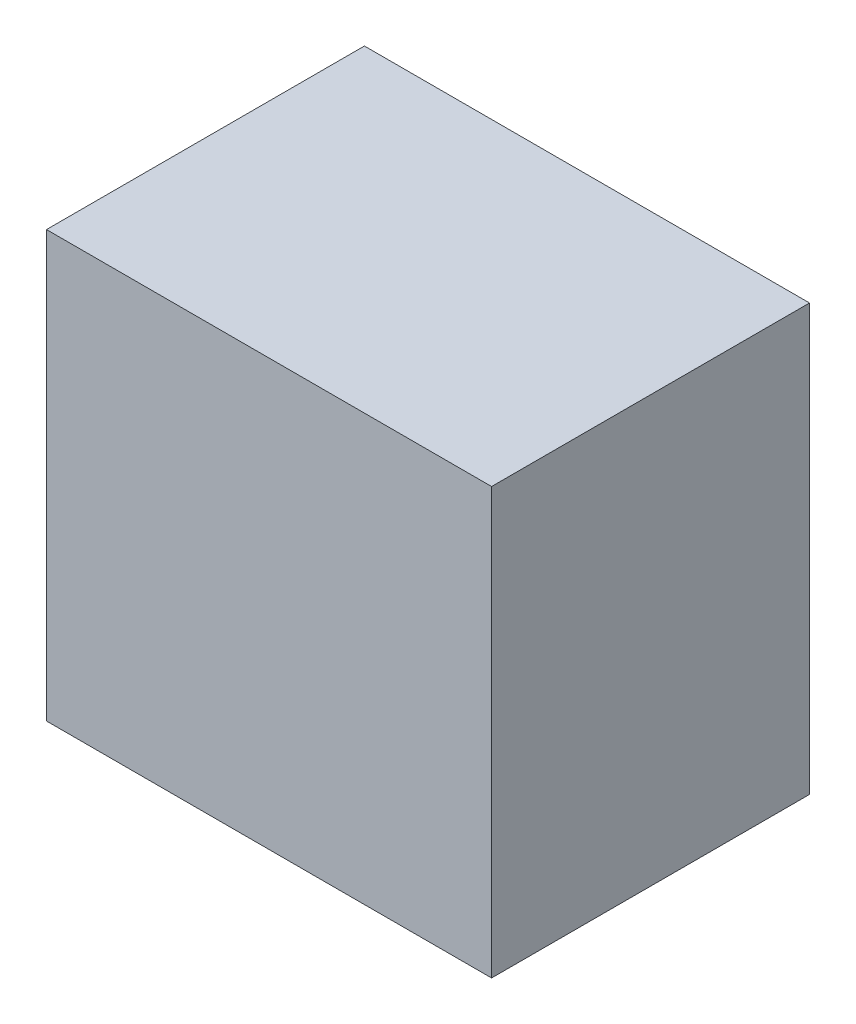
ISO-10303-21;
HEADER;
FILE_DESCRIPTION(('STEP AP214'),'2;1');
FILE_NAME('part.step','',(''),(''),'','','');
FILE_SCHEMA(('AUTOMOTIVE_DESIGN { 1 0 10303 214 1 1 1 1 }'));
ENDSEC;
DATA;
#1=APPLICATION_CONTEXT('core data for automotive mechanical design processes');
#2=APPLICATION_PROTOCOL_DEFINITION('international standard','automotive_design',2000,#1);
#3=PRODUCT_CONTEXT('',#1,'mechanical');
#4=PRODUCT('Part','Part','',(#3));
#5=PRODUCT_RELATED_PRODUCT_CATEGORY('part','',(#4));
#6=PRODUCT_DEFINITION_FORMATION('','',#4);
#7=PRODUCT_DEFINITION_CONTEXT('part definition',#1,'design');
#8=PRODUCT_DEFINITION('design','',#6,#7);
#9=PRODUCT_DEFINITION_SHAPE('','',#8);
#10=(LENGTH_UNIT() NAMED_UNIT(*) SI_UNIT(.MILLI.,.METRE.));
#11=(NAMED_UNIT(*) PLANE_ANGLE_UNIT() SI_UNIT($,.RADIAN.));
#12=(NAMED_UNIT(*) SI_UNIT($,.STERADIAN.) SOLID_ANGLE_UNIT());
#13=UNCERTAINTY_MEASURE_WITH_UNIT(LENGTH_MEASURE(1.E-05),#10,'distance_accuracy_value','');
#14=(GEOMETRIC_REPRESENTATION_CONTEXT(3) GLOBAL_UNCERTAINTY_ASSIGNED_CONTEXT((#13)) GLOBAL_UNIT_ASSIGNED_CONTEXT((#10,
#11,#12)) REPRESENTATION_CONTEXT('',''));
#15=CARTESIAN_POINT('',(0.,0.,0.));
#16=DIRECTION('',(0.,0.,1.));
#17=DIRECTION('',(1.,0.,0.));
#18=AXIS2_PLACEMENT_3D('',#15,#16,#17);
#19=CARTESIAN_POINT('',(-68.7479338842975,74.7830578512396,127.));
#20=DIRECTION('',(1.,0.,0.));
#21=DIRECTION('',(0.,0.,-1.));
#22=AXIS2_PLACEMENT_3D('',#19,#20,#21);
#23=PLANE('',#22);
#24=DIRECTION('',(0.,-1.,0.));
#25=VECTOR('',#24,1.);
#26=CARTESIAN_POINT('',(-68.7479338842975,74.7830578512396,0.));
#27=LINE('',#26,#25);
#28=CARTESIAN_POINT('',(-68.7479338842975,74.7830578512396,0.));
#29=VERTEX_POINT('',#28);
#30=CARTESIAN_POINT('',(-68.7479338842975,-95.25,0.));
#31=VERTEX_POINT('',#30);
#32=EDGE_CURVE('E96',#29,#31,#27,.T.);
#33=ORIENTED_EDGE('',*,*,#32,.T.);
#34=DIRECTION('',(0.,0.,-1.));
#35=VECTOR('',#34,1.);
#36=CARTESIAN_POINT('',(-68.7479338842975,-95.25,127.));
#37=LINE('',#36,#35);
#38=CARTESIAN_POINT('',(-68.7479338842975,-95.25,127.));
#39=VERTEX_POINT('',#38);
#40=EDGE_CURVE('E11',#39,#31,#37,.T.);
#41=ORIENTED_EDGE('',*,*,#40,.F.);
#42=DIRECTION('',(0.,-1.,0.));
#43=VECTOR('',#42,1.);
#44=CARTESIAN_POINT('',(-68.7479338842975,74.7830578512396,127.));
#45=LINE('',#44,#43);
#46=CARTESIAN_POINT('',(-68.7479338842975,74.7830578512396,127.));
#47=VERTEX_POINT('',#46);
#48=EDGE_CURVE('E84',#47,#39,#45,.T.);
#49=ORIENTED_EDGE('',*,*,#48,.F.);
#50=DIRECTION('',(0.,0.,-1.));
#51=VECTOR('',#50,1.);
#52=CARTESIAN_POINT('',(-68.7479338842975,74.7830578512396,127.));
#53=LINE('',#52,#51);
#54=EDGE_CURVE('E92',#47,#29,#53,.T.);
#55=ORIENTED_EDGE('',*,*,#54,.T.);
#56=EDGE_LOOP('',(#33,#41,#49,#55));
#57=FACE_BOUND('',#56,.T.);
#58=ADVANCED_FACE('F33',(#57),#23,.F.);
#59=CARTESIAN_POINT('',(-68.7479338842975,-95.25,127.));
#60=DIRECTION('',(0.,1.,0.));
#61=DIRECTION('',(0.,0.,1.));
#62=AXIS2_PLACEMENT_3D('',#59,#60,#61);
#63=PLANE('',#62);
#64=DIRECTION('',(1.,0.,0.));
#65=VECTOR('',#64,1.);
#66=CARTESIAN_POINT('',(-68.7479338842975,-95.25,0.));
#67=LINE('',#66,#65);
#68=CARTESIAN_POINT('',(109.052066115702,-95.25,0.));
#69=VERTEX_POINT('',#68);
#70=EDGE_CURVE('E88',#31,#69,#67,.T.);
#71=ORIENTED_EDGE('',*,*,#70,.T.);
#72=DIRECTION('',(0.,0.,-1.));
#73=VECTOR('',#72,1.);
#74=CARTESIAN_POINT('',(109.052066115702,-95.25,127.));
#75=LINE('',#74,#73);
#76=CARTESIAN_POINT('',(109.052066115702,-95.25,127.));
#77=VERTEX_POINT('',#76);
#78=EDGE_CURVE('E41',#77,#69,#75,.T.);
#79=ORIENTED_EDGE('',*,*,#78,.F.);
#80=DIRECTION('',(1.,0.,0.));
#81=VECTOR('',#80,1.);
#82=CARTESIAN_POINT('',(-68.7479338842975,-95.25,127.));
#83=LINE('',#82,#81);
#84=EDGE_CURVE('E79',#39,#77,#83,.T.);
#85=ORIENTED_EDGE('',*,*,#84,.F.);
#86=ORIENTED_EDGE('',*,*,#40,.T.);
#87=EDGE_LOOP('',(#71,#79,#85,#86));
#88=FACE_BOUND('',#87,.T.);
#89=ADVANCED_FACE('F87',(#88),#63,.F.);
#90=CARTESIAN_POINT('',(109.052066115702,74.7830578512396,127.));
#91=DIRECTION('',(-1.,0.,0.));
#92=DIRECTION('',(0.,-1.,0.));
#93=AXIS2_PLACEMENT_3D('',#90,#91,#92);
#94=PLANE('',#93);
#95=DIRECTION('',(0.,1.,0.));
#96=VECTOR('',#95,1.);
#97=CARTESIAN_POINT('',(109.052066115702,74.7830578512396,0.));
#98=LINE('',#97,#96);
#99=CARTESIAN_POINT('',(109.052066115702,74.7830578512396,0.));
#100=VERTEX_POINT('',#99);
#101=EDGE_CURVE('E66',#69,#100,#98,.T.);
#102=ORIENTED_EDGE('',*,*,#101,.T.);
#103=DIRECTION('',(0.,0.,-1.));
#104=VECTOR('',#103,1.);
#105=CARTESIAN_POINT('',(109.052066115702,74.7830578512396,127.));
#106=LINE('',#105,#104);
#107=CARTESIAN_POINT('',(109.052066115702,74.7830578512396,127.));
#108=VERTEX_POINT('',#107);
#109=EDGE_CURVE('E89',#108,#100,#106,.T.);
#110=ORIENTED_EDGE('',*,*,#109,.F.);
#111=DIRECTION('',(0.,1.,0.));
#112=VECTOR('',#111,1.);
#113=CARTESIAN_POINT('',(109.052066115702,74.7830578512396,127.));
#114=LINE('',#113,#112);
#115=EDGE_CURVE('E82',#77,#108,#114,.T.);
#116=ORIENTED_EDGE('',*,*,#115,.F.);
#117=ORIENTED_EDGE('',*,*,#78,.T.);
#118=EDGE_LOOP('',(#102,#110,#116,#117));
#119=FACE_BOUND('',#118,.T.);
#120=ADVANCED_FACE('F90',(#119),#94,.F.);
#121=CARTESIAN_POINT('',(-68.7479338842975,74.7830578512396,127.));
#122=DIRECTION('',(0.,-1.,0.));
#123=DIRECTION('',(0.,0.,-1.));
#124=AXIS2_PLACEMENT_3D('',#121,#122,#123);
#125=PLANE('',#124);
#126=DIRECTION('',(-1.,0.,0.));
#127=VECTOR('',#126,1.);
#128=CARTESIAN_POINT('',(-68.7479338842975,74.7830578512396,0.));
#129=LINE('',#128,#127);
#130=EDGE_CURVE('E72',#100,#29,#129,.T.);
#131=ORIENTED_EDGE('',*,*,#130,.T.);
#132=ORIENTED_EDGE('',*,*,#54,.F.);
#133=DIRECTION('',(-1.,0.,0.));
#134=VECTOR('',#133,1.);
#135=CARTESIAN_POINT('',(-68.7479338842975,74.7830578512396,127.));
#136=LINE('',#135,#134);
#137=EDGE_CURVE('E49',#108,#47,#136,.T.);
#138=ORIENTED_EDGE('',*,*,#137,.F.);
#139=ORIENTED_EDGE('',*,*,#109,.T.);
#140=EDGE_LOOP('',(#131,#132,#138,#139));
#141=FACE_BOUND('',#140,.T.);
#142=ADVANCED_FACE('F103',(#141),#125,.F.);
#143=CARTESIAN_POINT('',(0.,0.,127.));
#144=DIRECTION('',(0.,0.,1.));
#145=DIRECTION('',(1.,0.,0.));
#146=AXIS2_PLACEMENT_3D('',#143,#144,#145);
#147=PLANE('',#146);
#148=ORIENTED_EDGE('',*,*,#48,.T.);
#149=ORIENTED_EDGE('',*,*,#84,.T.);
#150=ORIENTED_EDGE('',*,*,#115,.T.);
#151=ORIENTED_EDGE('',*,*,#137,.T.);
#152=EDGE_LOOP('',(#148,#149,#150,#151));
#153=FACE_BOUND('',#152,.T.);
#154=ADVANCED_FACE('F80',(#153),#147,.T.);
#155=CARTESIAN_POINT('',(0.,0.,0.));
#156=DIRECTION('',(0.,0.,1.));
#157=DIRECTION('',(1.,0.,0.));
#158=AXIS2_PLACEMENT_3D('',#155,#156,#157);
#159=PLANE('',#158);
#160=ORIENTED_EDGE('',*,*,#32,.F.);
#161=ORIENTED_EDGE('',*,*,#130,.F.);
#162=ORIENTED_EDGE('',*,*,#101,.F.);
#163=ORIENTED_EDGE('',*,*,#70,.F.);
#164=EDGE_LOOP('',(#160,#161,#162,#163));
#165=FACE_BOUND('',#164,.T.);
#166=ADVANCED_FACE('F106',(#165),#159,.F.);
#167=CLOSED_SHELL('',(#58,#89,#120,#142,#154,#166));
#168=MANIFOLD_SOLID_BREP('B2',#167);
#169=ADVANCED_BREP_SHAPE_REPRESENTATION('',(#18,#168),#14);
#170=SHAPE_DEFINITION_REPRESENTATION(#9,#169);
ENDSEC;
END-ISO-10303-21;
